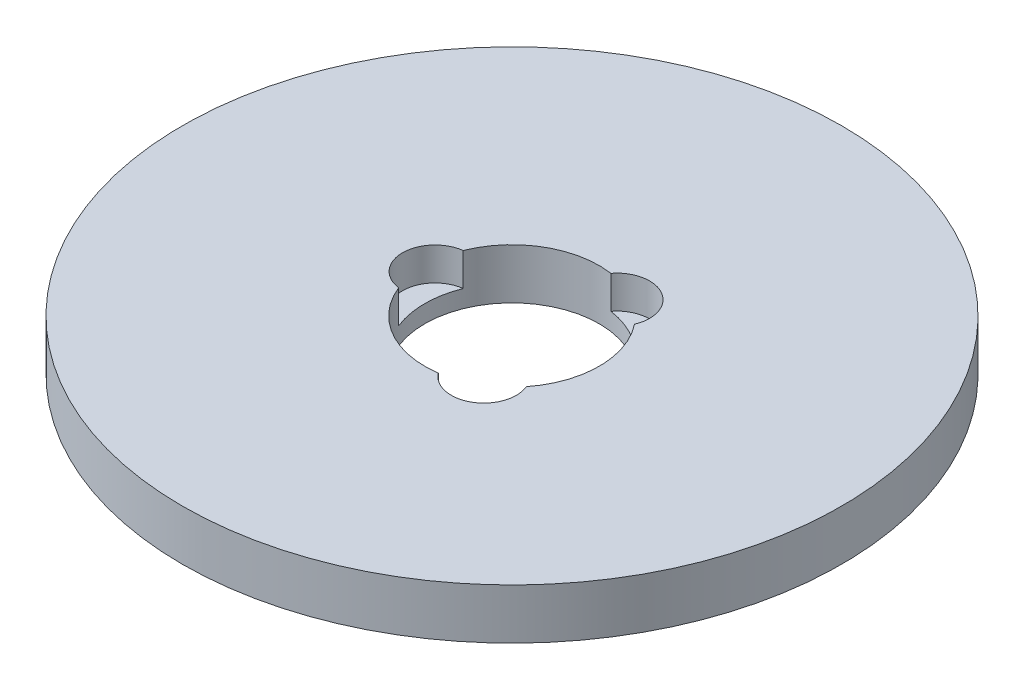
ISO-10303-21;
HEADER;
FILE_DESCRIPTION(('STEP AP214'),'2;1');
FILE_NAME('part.step','',(''),(''),'','','');
FILE_SCHEMA(('AUTOMOTIVE_DESIGN { 1 0 10303 214 1 1 1 1 }'));
ENDSEC;
DATA;
#1=APPLICATION_CONTEXT('core data for automotive mechanical design processes');
#2=APPLICATION_PROTOCOL_DEFINITION('international standard','automotive_design',2000,#1);
#3=PRODUCT_CONTEXT('',#1,'mechanical');
#4=PRODUCT('Part','Part','',(#3));
#5=PRODUCT_RELATED_PRODUCT_CATEGORY('part','',(#4));
#6=PRODUCT_DEFINITION_FORMATION('','',#4);
#7=PRODUCT_DEFINITION_CONTEXT('part definition',#1,'design');
#8=PRODUCT_DEFINITION('design','',#6,#7);
#9=PRODUCT_DEFINITION_SHAPE('','',#8);
#10=(LENGTH_UNIT() NAMED_UNIT(*) SI_UNIT(.MILLI.,.METRE.));
#11=(NAMED_UNIT(*) PLANE_ANGLE_UNIT() SI_UNIT($,.RADIAN.));
#12=(NAMED_UNIT(*) SI_UNIT($,.STERADIAN.) SOLID_ANGLE_UNIT());
#13=UNCERTAINTY_MEASURE_WITH_UNIT(LENGTH_MEASURE(1.E-05),#10,'distance_accuracy_value','');
#14=(GEOMETRIC_REPRESENTATION_CONTEXT(3) GLOBAL_UNCERTAINTY_ASSIGNED_CONTEXT((#13)) GLOBAL_UNIT_ASSIGNED_CONTEXT((#10,
#11,#12)) REPRESENTATION_CONTEXT('',''));
#15=CARTESIAN_POINT('',(0.,0.,0.));
#16=DIRECTION('',(0.,0.,1.));
#17=DIRECTION('',(1.,0.,0.));
#18=AXIS2_PLACEMENT_3D('',#15,#16,#17);
#19=CARTESIAN_POINT('',(0.,13.,0.));
#20=DIRECTION('',(0.,-1.,0.));
#21=DIRECTION('',(0.,0.,-1.));
#22=AXIS2_PLACEMENT_3D('',#19,#20,#21);
#23=CYLINDRICAL_SURFACE('',#22,85.);
#24=CARTESIAN_POINT('',(0.,13.,0.));
#25=DIRECTION('',(0.,1.,0.));
#26=DIRECTION('',(0.,0.,1.));
#27=AXIS2_PLACEMENT_3D('',#24,#25,#26);
#28=CIRCLE('',#27,85.);
#29=CARTESIAN_POINT('',(0.,13.,-85.));
#30=VERTEX_POINT('',#29);
#31=EDGE_CURVE('E130',#30,#30,#28,.T.);
#32=CARTESIAN_POINT('',(0.,0.,0.));
#33=DIRECTION('',(0.,1.,0.));
#34=DIRECTION('',(0.,0.,1.));
#35=AXIS2_PLACEMENT_3D('',#32,#33,#34);
#36=CIRCLE('',#35,85.);
#37=CARTESIAN_POINT('',(0.,0.,-85.));
#38=VERTEX_POINT('',#37);
#39=EDGE_CURVE('E117',#38,#38,#36,.T.);
#40=CARTESIAN_POINT('',(0.,13.,-85.));
#41=CARTESIAN_POINT('',(0.,12.8645833333333,-85.));
#42=CARTESIAN_POINT('',(0.,12.7291666666667,-85.));
#43=CARTESIAN_POINT('',(0.,12.4583333333333,-85.));
#44=CARTESIAN_POINT('',(0.,12.3229166666667,-85.));
#45=CARTESIAN_POINT('',(0.,12.0520833333333,-85.));
#46=CARTESIAN_POINT('',(0.,11.9166666666667,-85.));
#47=CARTESIAN_POINT('',(0.,11.6458333333333,-85.));
#48=CARTESIAN_POINT('',(0.,11.5104166666667,-85.));
#49=CARTESIAN_POINT('',(0.,11.2395833333333,-85.));
#50=CARTESIAN_POINT('',(0.,11.1041666666667,-85.));
#51=CARTESIAN_POINT('',(0.,10.8333333333333,-85.));
#52=CARTESIAN_POINT('',(0.,10.6979166666667,-85.));
#53=CARTESIAN_POINT('',(0.,10.4270833333333,-85.));
#54=CARTESIAN_POINT('',(0.,10.2916666666667,-85.));
#55=CARTESIAN_POINT('',(0.,10.0208333333333,-85.));
#56=CARTESIAN_POINT('',(0.,9.88541666666667,-85.));
#57=CARTESIAN_POINT('',(0.,9.61458333333333,-85.));
#58=CARTESIAN_POINT('',(0.,9.47916666666667,-85.));
#59=CARTESIAN_POINT('',(0.,9.20833333333333,-85.));
#60=CARTESIAN_POINT('',(0.,9.07291666666666,-85.));
#61=CARTESIAN_POINT('',(0.,8.80208333333333,-85.));
#62=CARTESIAN_POINT('',(0.,8.66666666666667,-85.));
#63=CARTESIAN_POINT('',(0.,8.39583333333333,-85.));
#64=CARTESIAN_POINT('',(0.,8.26041666666667,-85.));
#65=CARTESIAN_POINT('',(0.,7.98958333333333,-85.));
#66=CARTESIAN_POINT('',(0.,7.85416666666667,-85.));
#67=CARTESIAN_POINT('',(0.,7.58333333333333,-85.));
#68=CARTESIAN_POINT('',(0.,7.44791666666667,-85.));
#69=CARTESIAN_POINT('',(0.,7.17708333333333,-85.));
#70=CARTESIAN_POINT('',(0.,7.04166666666667,-85.));
#71=CARTESIAN_POINT('',(0.,6.77083333333333,-85.));
#72=CARTESIAN_POINT('',(0.,6.63541666666667,-85.));
#73=CARTESIAN_POINT('',(0.,6.36458333333333,-85.));
#74=CARTESIAN_POINT('',(0.,6.22916666666667,-85.));
#75=CARTESIAN_POINT('',(0.,5.95833333333333,-85.));
#76=CARTESIAN_POINT('',(0.,5.82291666666667,-85.));
#77=CARTESIAN_POINT('',(0.,5.55208333333333,-85.));
#78=CARTESIAN_POINT('',(0.,5.41666666666667,-85.));
#79=CARTESIAN_POINT('',(0.,5.14583333333333,-85.));
#80=CARTESIAN_POINT('',(0.,5.01041666666667,-85.));
#81=CARTESIAN_POINT('',(0.,4.73958333333333,-85.));
#82=CARTESIAN_POINT('',(0.,4.60416666666667,-85.));
#83=CARTESIAN_POINT('',(0.,4.33333333333333,-85.));
#84=CARTESIAN_POINT('',(0.,4.19791666666667,-85.));
#85=CARTESIAN_POINT('',(0.,3.92708333333333,-85.));
#86=CARTESIAN_POINT('',(0.,3.79166666666667,-85.));
#87=CARTESIAN_POINT('',(0.,3.52083333333333,-85.));
#88=CARTESIAN_POINT('',(0.,3.38541666666667,-85.));
#89=CARTESIAN_POINT('',(0.,3.11458333333333,-85.));
#90=CARTESIAN_POINT('',(0.,2.97916666666667,-85.));
#91=CARTESIAN_POINT('',(0.,2.70833333333333,-85.));
#92=CARTESIAN_POINT('',(0.,2.57291666666667,-85.));
#93=CARTESIAN_POINT('',(0.,2.30208333333333,-85.));
#94=CARTESIAN_POINT('',(0.,2.16666666666667,-85.));
#95=CARTESIAN_POINT('',(0.,1.89583333333333,-85.));
#96=CARTESIAN_POINT('',(0.,1.76041666666667,-85.));
#97=CARTESIAN_POINT('',(0.,1.48958333333333,-85.));
#98=CARTESIAN_POINT('',(0.,1.35416666666667,-85.));
#99=CARTESIAN_POINT('',(0.,1.08333333333333,-85.));
#100=CARTESIAN_POINT('',(0.,0.947916666666667,-85.));
#101=CARTESIAN_POINT('',(0.,0.677083333333334,-85.));
#102=CARTESIAN_POINT('',(0.,0.541666666666667,-85.));
#103=CARTESIAN_POINT('',(0.,0.270833333333334,-85.));
#104=CARTESIAN_POINT('',(0.,0.135416666666667,-85.));
#105=CARTESIAN_POINT('',(0.,0.,-85.));
#106=B_SPLINE_CURVE_WITH_KNOTS('',3,(#40,#41,#42,#43,#44,#45,#46,#47,#48,#49,#50,#51,#52,#53,
#54,#55,#56,#57,#58,#59,#60,#61,#62,#63,#64,#65,#66,#67,#68,#69,#70,#71,#72,#73,#74,#75,#76,#77,
#78,#79,#80,#81,#82,#83,#84,#85,#86,#87,#88,#89,#90,#91,#92,#93,#94,#95,#96,#97,#98,#99,#100,
#101,#102,#103,#104,#105),.UNSPECIFIED.,.F.,.F.,(4,2,2,2,2,2,2,2,2,2,2,2,2,2,2,2,2,2,2,2,2,2,2,
2,2,2,2,2,2,2,2,2,4),(0.,0.40625,0.812500000000001,1.21875,1.625,2.03125,2.4375,2.84375,3.25,
3.65625,4.0625,4.46875,4.875,5.28125,5.6875,6.09375,6.5,6.90625,7.3125,7.71875,8.125,8.53125,
8.9375,9.34375,9.75,10.15625,10.5625,10.96875,11.375,11.78125,12.1875,12.59375,13.),.UNSPECIFIED.);
#107=EDGE_CURVE('BSEAM39',#30,#38,#106,.T.);
#108=ORIENTED_EDGE('',*,*,#31,.F.);
#109=ORIENTED_EDGE('',*,*,#39,.T.);
#110=ORIENTED_EDGE('',*,*,#107,.T.);
#111=ORIENTED_EDGE('',*,*,#107,.F.);
#112=EDGE_LOOP('',(#108,#110,#109,#111));
#113=FACE_BOUND('',#112,.T.);
#114=ADVANCED_FACE('F39',(#113),#23,.T.);
#115=CARTESIAN_POINT('',(0.,13.,0.));
#116=DIRECTION('',(0.,1.,0.));
#117=DIRECTION('',(0.,0.,1.));
#118=AXIS2_PLACEMENT_3D('',#115,#116,#117);
#119=PLANE('',#118);
#120=CARTESIAN_POINT('',(9.91970809511543,13.,17.181438416992));
#121=DIRECTION('',(0.,1.,0.));
#122=DIRECTION('',(0.866025403784436,0.,-0.500000000000004));
#123=AXIS2_PLACEMENT_3D('',#120,#121,#122);
#124=CIRCLE('',#123,8.3868852404419);
#125=CARTESIAN_POINT('',(3.24851637790576,13.,22.2642570354925));
#126=VERTEX_POINT('',#125);
#127=CARTESIAN_POINT('',(17.6571540001702,13.,13.9454262256223));
#128=VERTEX_POINT('',#127);
#129=EDGE_CURVE('E148',#126,#128,#124,.T.);
#130=ORIENTED_EDGE('',*,*,#129,.F.);
#131=CARTESIAN_POINT('',(0.,13.,0.));
#132=DIRECTION('',(0.,1.,0.));
#133=DIRECTION('',(0.,0.,1.));
#134=AXIS2_PLACEMENT_3D('',#131,#132,#133);
#135=CIRCLE('',#134,22.5);
#136=CARTESIAN_POINT('',(-20.9056703780758,13.,8.31883080987016));
#137=VERTEX_POINT('',#136);
#138=EDGE_CURVE('E113',#137,#126,#135,.T.);
#139=ORIENTED_EDGE('',*,*,#138,.F.);
#140=CARTESIAN_POINT('',(-19.8394161902307,13.,0.));
#141=DIRECTION('',(0.,1.,0.));
#142=DIRECTION('',(0.,0.,1.));
#143=AXIS2_PLACEMENT_3D('',#140,#141,#142);
#144=CIRCLE('',#143,8.3868852404419);
#145=CARTESIAN_POINT('',(-20.9056703780758,13.,-8.31883080987016));
#146=VERTEX_POINT('',#145);
#147=EDGE_CURVE('E125',#146,#137,#144,.T.);
#148=ORIENTED_EDGE('',*,*,#147,.F.);
#149=CARTESIAN_POINT('',(3.24851637790545,13.,-22.2642570354926));
#150=VERTEX_POINT('',#149);
#151=EDGE_CURVE('E107',#150,#146,#135,.T.);
#152=ORIENTED_EDGE('',*,*,#151,.F.);
#153=CARTESIAN_POINT('',(9.91970809511519,13.,-17.1814384169922));
#154=DIRECTION('',(0.,1.,0.));
#155=DIRECTION('',(-0.866025403784443,0.,-0.499999999999992));
#156=AXIS2_PLACEMENT_3D('',#153,#154,#155);
#157=CIRCLE('',#156,8.3868852404419);
#158=CARTESIAN_POINT('',(17.65715400017,13.,-13.9454262256225));
#159=VERTEX_POINT('',#158);
#160=EDGE_CURVE('E95',#159,#150,#157,.T.);
#161=ORIENTED_EDGE('',*,*,#160,.F.);
#162=EDGE_CURVE('E106',#128,#159,#135,.T.);
#163=ORIENTED_EDGE('',*,*,#162,.F.);
#164=EDGE_LOOP('',(#130,#139,#148,#152,#161,#163));
#165=FACE_BOUND('',#164,.T.);
#166=ORIENTED_EDGE('',*,*,#31,.T.);
#167=EDGE_LOOP('',(#166));
#168=FACE_BOUND('',#167,.T.);
#169=ADVANCED_FACE('F102',(#165,#168),#119,.T.);
#170=CARTESIAN_POINT('',(0.,0.,0.));
#171=DIRECTION('',(0.,1.,0.));
#172=DIRECTION('',(0.,0.,1.));
#173=AXIS2_PLACEMENT_3D('',#170,#171,#172);
#174=PLANE('',#173);
#175=CARTESIAN_POINT('',(0.,0.,0.));
#176=DIRECTION('',(0.,1.,0.));
#177=DIRECTION('',(0.,0.,1.));
#178=AXIS2_PLACEMENT_3D('',#175,#176,#177);
#179=CIRCLE('',#178,22.5);
#180=CARTESIAN_POINT('',(0.,0.,22.5));
#181=VERTEX_POINT('',#180);
#182=EDGE_CURVE('E118',#181,#181,#179,.T.);
#183=ORIENTED_EDGE('',*,*,#182,.T.);
#184=EDGE_LOOP('',(#183));
#185=FACE_BOUND('',#184,.T.);
#186=ORIENTED_EDGE('',*,*,#39,.F.);
#187=EDGE_LOOP('',(#186));
#188=FACE_BOUND('',#187,.T.);
#189=ADVANCED_FACE('F161',(#185,#188),#174,.F.);
#190=CARTESIAN_POINT('',(0.,13.,0.));
#191=DIRECTION('',(0.,-1.,0.));
#192=DIRECTION('',(0.,0.,-1.));
#193=AXIS2_PLACEMENT_3D('',#190,#191,#192);
#194=CYLINDRICAL_SURFACE('',#193,22.5);
#195=DIRECTION('',(0.,1.,0.));
#196=VECTOR('',#195,1.);
#197=CARTESIAN_POINT('',(3.24851637790575,8.75522928915034,22.2642570354925));
#198=LINE('',#197,#196);
#199=CARTESIAN_POINT('',(3.24851637790576,4.51045857830068,22.2642570354925));
#200=VERTEX_POINT('',#199);
#201=EDGE_CURVE('E11',#200,#126,#198,.T.);
#202=ORIENTED_EDGE('',*,*,#201,.F.);
#203=CARTESIAN_POINT('',(0.,4.51045857830068,0.));
#204=DIRECTION('',(0.,1.,0.));
#205=DIRECTION('',(0.,0.,1.));
#206=AXIS2_PLACEMENT_3D('',#203,#204,#205);
#207=CIRCLE('',#206,22.5);
#208=CARTESIAN_POINT('',(17.6571540001702,4.51045857830068,13.9454262256223));
#209=VERTEX_POINT('',#208);
#210=EDGE_CURVE('E100',#200,#209,#207,.T.);
#211=ORIENTED_EDGE('',*,*,#210,.T.);
#212=DIRECTION('',(0.,1.,0.));
#213=VECTOR('',#212,1.);
#214=CARTESIAN_POINT('',(17.6571540001702,8.75522928915034,13.9454262256223));
#215=LINE('',#214,#213);
#216=EDGE_CURVE('E46',#128,#209,#215,.F.);
#217=ORIENTED_EDGE('',*,*,#216,.F.);
#218=ORIENTED_EDGE('',*,*,#162,.T.);
#219=DIRECTION('',(0.,1.,0.));
#220=VECTOR('',#219,1.);
#221=CARTESIAN_POINT('',(17.65715400017,8.75522928915034,-13.9454262256225));
#222=LINE('',#221,#220);
#223=CARTESIAN_POINT('',(17.65715400017,4.51045857830068,-13.9454262256225));
#224=VERTEX_POINT('',#223);
#225=EDGE_CURVE('E90',#224,#159,#222,.T.);
#226=ORIENTED_EDGE('',*,*,#225,.F.);
#227=CARTESIAN_POINT('',(0.,4.51045857830068,0.));
#228=DIRECTION('',(0.,1.,0.));
#229=DIRECTION('',(0.,0.,1.));
#230=AXIS2_PLACEMENT_3D('',#227,#228,#229);
#231=CIRCLE('',#230,22.5);
#232=CARTESIAN_POINT('',(3.24851637790545,4.51045857830068,-22.2642570354926));
#233=VERTEX_POINT('',#232);
#234=EDGE_CURVE('E143',#224,#233,#231,.T.);
#235=ORIENTED_EDGE('',*,*,#234,.T.);
#236=DIRECTION('',(0.,1.,0.));
#237=VECTOR('',#236,1.);
#238=CARTESIAN_POINT('',(3.24851637790545,8.75522928915034,-22.2642570354926));
#239=LINE('',#238,#237);
#240=EDGE_CURVE('E98',#150,#233,#239,.F.);
#241=ORIENTED_EDGE('',*,*,#240,.F.);
#242=ORIENTED_EDGE('',*,*,#151,.T.);
#243=DIRECTION('',(0.,1.,0.));
#244=VECTOR('',#243,1.);
#245=CARTESIAN_POINT('',(-20.9056703780758,8.75522928915034,-8.31883080987016));
#246=LINE('',#245,#244);
#247=CARTESIAN_POINT('',(-20.9056703780758,4.51045857830068,-8.31883080987016));
#248=VERTEX_POINT('',#247);
#249=EDGE_CURVE('E137',#248,#146,#246,.T.);
#250=ORIENTED_EDGE('',*,*,#249,.F.);
#251=CARTESIAN_POINT('',(0.,4.51045857830068,0.));
#252=DIRECTION('',(0.,1.,0.));
#253=DIRECTION('',(0.,0.,1.));
#254=AXIS2_PLACEMENT_3D('',#251,#252,#253);
#255=CIRCLE('',#254,22.5);
#256=CARTESIAN_POINT('',(-20.9056703780758,4.51045857830068,8.31883080987016));
#257=VERTEX_POINT('',#256);
#258=EDGE_CURVE('E128',#248,#257,#255,.T.);
#259=ORIENTED_EDGE('',*,*,#258,.T.);
#260=DIRECTION('',(0.,1.,0.));
#261=VECTOR('',#260,1.);
#262=CARTESIAN_POINT('',(-20.9056703780758,8.75522928915034,8.31883080987016));
#263=LINE('',#262,#261);
#264=EDGE_CURVE('E134',#137,#257,#263,.F.);
#265=ORIENTED_EDGE('',*,*,#264,.F.);
#266=ORIENTED_EDGE('',*,*,#138,.T.);
#267=EDGE_LOOP('',(#202,#211,#217,#218,#226,#235,#241,#242,#250,#259,#265,#266));
#268=FACE_BOUND('',#267,.T.);
#269=ORIENTED_EDGE('',*,*,#182,.F.);
#270=EDGE_LOOP('',(#269));
#271=FACE_BOUND('',#270,.T.);
#272=ADVANCED_FACE('F115',(#268,#271),#194,.F.);
#273=CARTESIAN_POINT('',(-19.8394161902307,4.51045857830068,0.));
#274=DIRECTION('',(0.,1.,0.));
#275=DIRECTION('',(0.,0.,1.));
#276=AXIS2_PLACEMENT_3D('',#273,#274,#275);
#277=CYLINDRICAL_SURFACE('',#276,8.3868852404419);
#278=ORIENTED_EDGE('',*,*,#249,.T.);
#279=ORIENTED_EDGE('',*,*,#147,.T.);
#280=ORIENTED_EDGE('',*,*,#264,.T.);
#281=CARTESIAN_POINT('',(-19.8394161902307,4.51045857830068,0.));
#282=DIRECTION('',(0.,1.,0.));
#283=DIRECTION('',(0.,0.,1.));
#284=AXIS2_PLACEMENT_3D('',#281,#282,#283);
#285=CIRCLE('',#284,8.3868852404419);
#286=EDGE_CURVE('E127',#248,#257,#285,.T.);
#287=ORIENTED_EDGE('',*,*,#286,.F.);
#288=EDGE_LOOP('',(#278,#279,#280,#287));
#289=FACE_BOUND('',#288,.T.);
#290=ADVANCED_FACE('F175',(#289),#277,.F.);
#291=CARTESIAN_POINT('',(-19.8394161902307,4.51045857830068,0.));
#292=DIRECTION('',(0.,1.,0.));
#293=DIRECTION('',(0.,0.,1.));
#294=AXIS2_PLACEMENT_3D('',#291,#292,#293);
#295=PLANE('',#294);
#296=ORIENTED_EDGE('',*,*,#286,.T.);
#297=ORIENTED_EDGE('',*,*,#258,.F.);
#298=EDGE_LOOP('',(#296,#297));
#299=FACE_BOUND('',#298,.T.);
#300=ADVANCED_FACE('F176',(#299),#295,.T.);
#301=CARTESIAN_POINT('',(9.91970809511519,4.51045857830068,-17.1814384169922));
#302=DIRECTION('',(0.,1.,0.));
#303=DIRECTION('',(0.,0.,1.));
#304=AXIS2_PLACEMENT_3D('',#301,#302,#303);
#305=CYLINDRICAL_SURFACE('',#304,8.3868852404419);
#306=ORIENTED_EDGE('',*,*,#225,.T.);
#307=ORIENTED_EDGE('',*,*,#160,.T.);
#308=ORIENTED_EDGE('',*,*,#240,.T.);
#309=CARTESIAN_POINT('',(9.91970809511519,4.51045857830068,-17.1814384169922));
#310=DIRECTION('',(0.,1.,0.));
#311=DIRECTION('',(-0.866025403784443,0.,-0.499999999999992));
#312=AXIS2_PLACEMENT_3D('',#309,#310,#311);
#313=CIRCLE('',#312,8.3868852404419);
#314=EDGE_CURVE('E56',#224,#233,#313,.T.);
#315=ORIENTED_EDGE('',*,*,#314,.F.);
#316=EDGE_LOOP('',(#306,#307,#308,#315));
#317=FACE_BOUND('',#316,.T.);
#318=ADVANCED_FACE('F93',(#317),#305,.F.);
#319=CARTESIAN_POINT('',(9.91970809511519,4.51045857830068,-17.1814384169922));
#320=DIRECTION('',(0.,1.,0.));
#321=DIRECTION('',(-0.866025403784443,0.,-0.499999999999992));
#322=AXIS2_PLACEMENT_3D('',#319,#320,#321);
#323=PLANE('',#322);
#324=ORIENTED_EDGE('',*,*,#314,.T.);
#325=ORIENTED_EDGE('',*,*,#234,.F.);
#326=EDGE_LOOP('',(#324,#325));
#327=FACE_BOUND('',#326,.T.);
#328=ADVANCED_FACE('F153',(#327),#323,.T.);
#329=CARTESIAN_POINT('',(9.91970809511543,4.51045857830068,17.181438416992));
#330=DIRECTION('',(0.,1.,0.));
#331=DIRECTION('',(0.,0.,1.));
#332=AXIS2_PLACEMENT_3D('',#329,#330,#331);
#333=CYLINDRICAL_SURFACE('',#332,8.3868852404419);
#334=ORIENTED_EDGE('',*,*,#201,.T.);
#335=ORIENTED_EDGE('',*,*,#129,.T.);
#336=ORIENTED_EDGE('',*,*,#216,.T.);
#337=CARTESIAN_POINT('',(9.91970809511543,4.51045857830068,17.181438416992));
#338=DIRECTION('',(0.,1.,0.));
#339=DIRECTION('',(0.866025403784436,0.,-0.500000000000004));
#340=AXIS2_PLACEMENT_3D('',#337,#338,#339);
#341=CIRCLE('',#340,8.3868852404419);
#342=EDGE_CURVE('E55',#200,#209,#341,.T.);
#343=ORIENTED_EDGE('',*,*,#342,.F.);
#344=EDGE_LOOP('',(#334,#335,#336,#343));
#345=FACE_BOUND('',#344,.T.);
#346=ADVANCED_FACE('F144',(#345),#333,.F.);
#347=CARTESIAN_POINT('',(9.91970809511543,4.51045857830068,17.181438416992));
#348=DIRECTION('',(0.,1.,0.));
#349=DIRECTION('',(0.866025403784436,0.,-0.500000000000004));
#350=AXIS2_PLACEMENT_3D('',#347,#348,#349);
#351=PLANE('',#350);
#352=ORIENTED_EDGE('',*,*,#342,.T.);
#353=ORIENTED_EDGE('',*,*,#210,.F.);
#354=EDGE_LOOP('',(#352,#353));
#355=FACE_BOUND('',#354,.T.);
#356=ADVANCED_FACE('F150',(#355),#351,.T.);
#357=CLOSED_SHELL('',(#114,#169,#189,#272,#290,#300,#318,#328,#346,#356));
#358=MANIFOLD_SOLID_BREP('B2',#357);
#359=ADVANCED_BREP_SHAPE_REPRESENTATION('',(#18,#358),#14);
#360=SHAPE_DEFINITION_REPRESENTATION(#9,#359);
ENDSEC;
END-ISO-10303-21;
